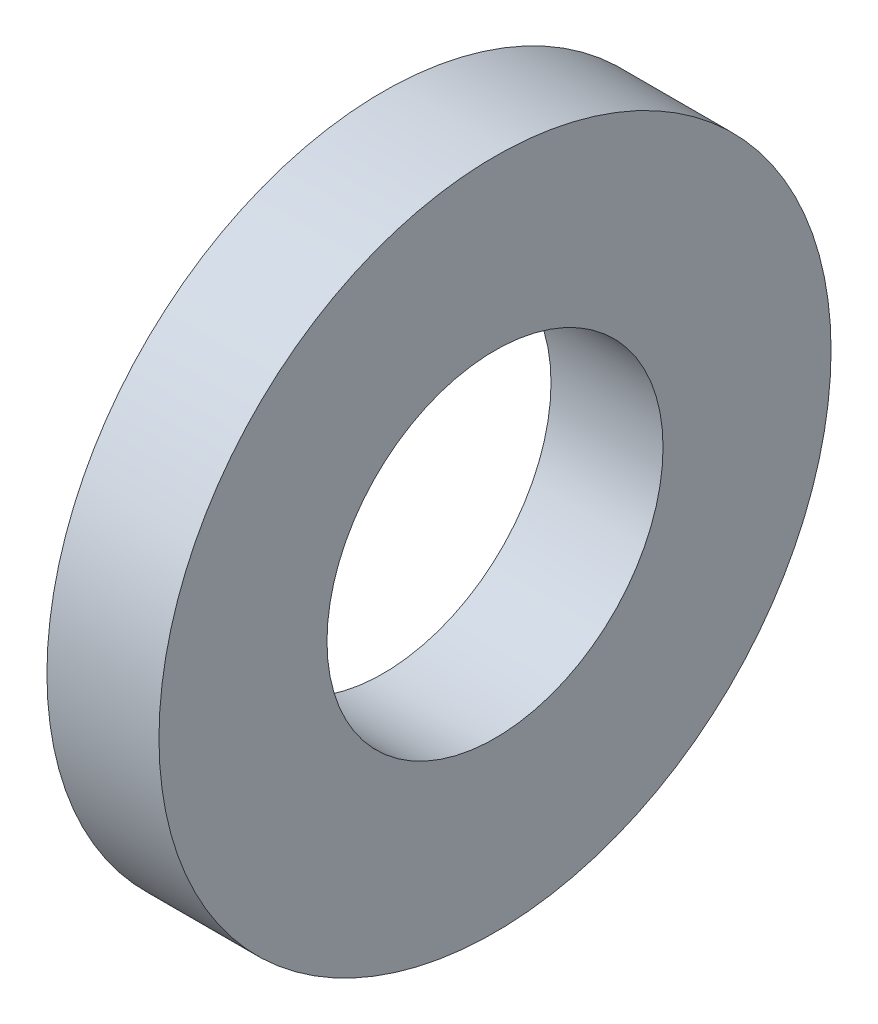
ISO-10303-21;
HEADER;
FILE_DESCRIPTION(('STEP AP214'),'2;1');
FILE_NAME('part.step','',(''),(''),'','','');
FILE_SCHEMA(('AUTOMOTIVE_DESIGN { 1 0 10303 214 1 1 1 1 }'));
ENDSEC;
DATA;
#1=APPLICATION_CONTEXT('core data for automotive mechanical design processes');
#2=APPLICATION_PROTOCOL_DEFINITION('international standard','automotive_design',2000,#1);
#3=PRODUCT_CONTEXT('',#1,'mechanical');
#4=PRODUCT('Part','Part','',(#3));
#5=PRODUCT_RELATED_PRODUCT_CATEGORY('part','',(#4));
#6=PRODUCT_DEFINITION_FORMATION('','',#4);
#7=PRODUCT_DEFINITION_CONTEXT('part definition',#1,'design');
#8=PRODUCT_DEFINITION('design','',#6,#7);
#9=PRODUCT_DEFINITION_SHAPE('','',#8);
#10=(LENGTH_UNIT() NAMED_UNIT(*) SI_UNIT(.MILLI.,.METRE.));
#11=(NAMED_UNIT(*) PLANE_ANGLE_UNIT() SI_UNIT($,.RADIAN.));
#12=(NAMED_UNIT(*) SI_UNIT($,.STERADIAN.) SOLID_ANGLE_UNIT());
#13=UNCERTAINTY_MEASURE_WITH_UNIT(LENGTH_MEASURE(1.E-05),#10,'distance_accuracy_value','');
#14=(GEOMETRIC_REPRESENTATION_CONTEXT(3) GLOBAL_UNCERTAINTY_ASSIGNED_CONTEXT((#13)) GLOBAL_UNIT_ASSIGNED_CONTEXT((#10,
#11,#12)) REPRESENTATION_CONTEXT('',''));
#15=CARTESIAN_POINT('',(0.,0.,0.));
#16=DIRECTION('',(0.,0.,1.));
#17=DIRECTION('',(1.,0.,0.));
#18=AXIS2_PLACEMENT_3D('',#15,#16,#17);
#19=CARTESIAN_POINT('',(0.,3.,0.));
#20=DIRECTION('',(1.,0.,0.));
#21=DIRECTION('',(0.,0.,-1.));
#22=AXIS2_PLACEMENT_3D('',#19,#20,#21);
#23=PLANE('',#22);
#24=CARTESIAN_POINT('',(0.,0.,0.));
#25=DIRECTION('',(-1.,0.,0.));
#26=DIRECTION('',(0.,0.,1.));
#27=AXIS2_PLACEMENT_3D('',#24,#25,#26);
#28=CIRCLE('',#27,1.5);
#29=CARTESIAN_POINT('',(0.,0.,1.5));
#30=VERTEX_POINT('',#29);
#31=EDGE_CURVE('E10',#30,#30,#28,.T.);
#32=ORIENTED_EDGE('',*,*,#31,.F.);
#33=EDGE_LOOP('',(#32));
#34=FACE_BOUND('',#33,.T.);
#35=CARTESIAN_POINT('',(0.,0.,0.));
#36=DIRECTION('',(-1.,0.,0.));
#37=DIRECTION('',(0.,0.,1.));
#38=AXIS2_PLACEMENT_3D('',#35,#36,#37);
#39=CIRCLE('',#38,3.);
#40=CARTESIAN_POINT('',(0.,0.,3.));
#41=VERTEX_POINT('',#40);
#42=EDGE_CURVE('E44',#41,#41,#39,.T.);
#43=ORIENTED_EDGE('',*,*,#42,.T.);
#44=EDGE_LOOP('',(#43));
#45=FACE_BOUND('',#44,.T.);
#46=ADVANCED_FACE('F30',(#34,#45),#23,.F.);
#47=CARTESIAN_POINT('',(0.,0.,0.));
#48=DIRECTION('',(-1.,0.,0.));
#49=DIRECTION('',(0.,0.,1.));
#50=AXIS2_PLACEMENT_3D('',#47,#48,#49);
#51=CYLINDRICAL_SURFACE('',#50,1.5);
#52=CARTESIAN_POINT('',(1.,0.,0.));
#53=DIRECTION('',(-1.,0.,0.));
#54=DIRECTION('',(0.,0.,1.));
#55=AXIS2_PLACEMENT_3D('',#52,#53,#54);
#56=CIRCLE('',#55,1.5);
#57=CARTESIAN_POINT('',(1.,0.,1.5));
#58=VERTEX_POINT('',#57);
#59=EDGE_CURVE('E36',#58,#58,#56,.T.);
#60=ORIENTED_EDGE('',*,*,#59,.F.);
#61=EDGE_LOOP('',(#60));
#62=FACE_BOUND('',#61,.T.);
#63=ORIENTED_EDGE('',*,*,#31,.T.);
#64=EDGE_LOOP('',(#63));
#65=FACE_BOUND('',#64,.T.);
#66=ADVANCED_FACE('F59',(#62,#65),#51,.F.);
#67=CARTESIAN_POINT('',(1.,3.,0.));
#68=DIRECTION('',(-1.,0.,0.));
#69=DIRECTION('',(0.,0.,1.));
#70=AXIS2_PLACEMENT_3D('',#67,#68,#69);
#71=PLANE('',#70);
#72=CARTESIAN_POINT('',(1.,0.,0.));
#73=DIRECTION('',(-1.,0.,0.));
#74=DIRECTION('',(0.,0.,1.));
#75=AXIS2_PLACEMENT_3D('',#72,#73,#74);
#76=CIRCLE('',#75,3.);
#77=CARTESIAN_POINT('',(1.,0.,3.));
#78=VERTEX_POINT('',#77);
#79=EDGE_CURVE('E40',#78,#78,#76,.T.);
#80=ORIENTED_EDGE('',*,*,#79,.F.);
#81=EDGE_LOOP('',(#80));
#82=FACE_BOUND('',#81,.T.);
#83=ORIENTED_EDGE('',*,*,#59,.T.);
#84=EDGE_LOOP('',(#83));
#85=FACE_BOUND('',#84,.T.);
#86=ADVANCED_FACE('F54',(#82,#85),#71,.F.);
#87=CARTESIAN_POINT('',(0.,0.,0.));
#88=DIRECTION('',(-1.,0.,0.));
#89=DIRECTION('',(0.,0.,1.));
#90=AXIS2_PLACEMENT_3D('',#87,#88,#89);
#91=CYLINDRICAL_SURFACE('',#90,3.);
#92=ORIENTED_EDGE('',*,*,#42,.F.);
#93=EDGE_LOOP('',(#92));
#94=FACE_BOUND('',#93,.T.);
#95=ORIENTED_EDGE('',*,*,#79,.T.);
#96=EDGE_LOOP('',(#95));
#97=FACE_BOUND('',#96,.T.);
#98=ADVANCED_FACE('F51',(#94,#97),#91,.T.);
#99=CLOSED_SHELL('',(#46,#66,#86,#98));
#100=MANIFOLD_SOLID_BREP('B2',#99);
#101=ADVANCED_BREP_SHAPE_REPRESENTATION('',(#18,#100),#14);
#102=SHAPE_DEFINITION_REPRESENTATION(#9,#101);
ENDSEC;
END-ISO-10303-21;
